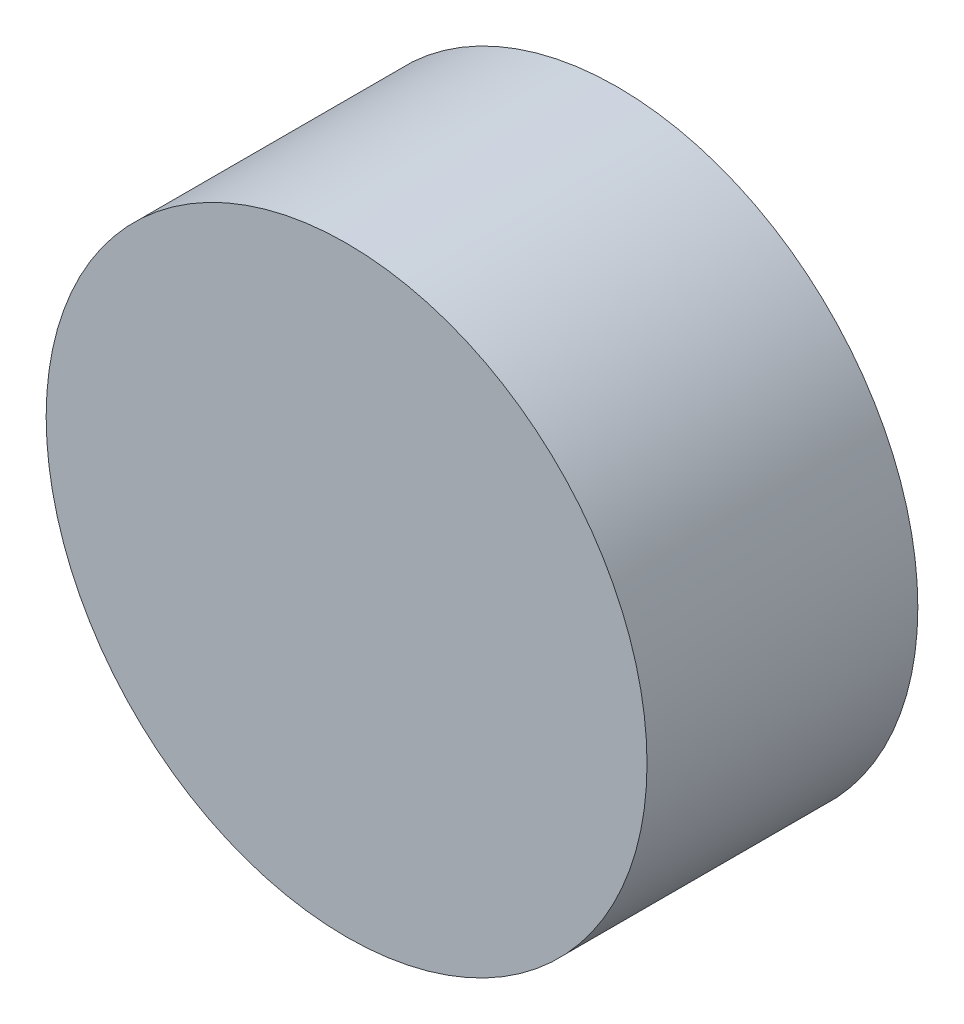
ISO-10303-21;
HEADER;
FILE_DESCRIPTION(('STEP AP214'),'2;1');
FILE_NAME('part.step','',(''),(''),'','','');
FILE_SCHEMA(('AUTOMOTIVE_DESIGN { 1 0 10303 214 1 1 1 1 }'));
ENDSEC;
DATA;
#1=APPLICATION_CONTEXT('core data for automotive mechanical design processes');
#2=APPLICATION_PROTOCOL_DEFINITION('international standard','automotive_design',2000,#1);
#3=PRODUCT_CONTEXT('',#1,'mechanical');
#4=PRODUCT('Part','Part','',(#3));
#5=PRODUCT_RELATED_PRODUCT_CATEGORY('part','',(#4));
#6=PRODUCT_DEFINITION_FORMATION('','',#4);
#7=PRODUCT_DEFINITION_CONTEXT('part definition',#1,'design');
#8=PRODUCT_DEFINITION('design','',#6,#7);
#9=PRODUCT_DEFINITION_SHAPE('','',#8);
#10=(LENGTH_UNIT() NAMED_UNIT(*) SI_UNIT(.MILLI.,.METRE.));
#11=(NAMED_UNIT(*) PLANE_ANGLE_UNIT() SI_UNIT($,.RADIAN.));
#12=(NAMED_UNIT(*) SI_UNIT($,.STERADIAN.) SOLID_ANGLE_UNIT());
#13=UNCERTAINTY_MEASURE_WITH_UNIT(LENGTH_MEASURE(1.E-05),#10,'distance_accuracy_value','');
#14=(GEOMETRIC_REPRESENTATION_CONTEXT(3) GLOBAL_UNCERTAINTY_ASSIGNED_CONTEXT((#13)) GLOBAL_UNIT_ASSIGNED_CONTEXT((#10,
#11,#12)) REPRESENTATION_CONTEXT('',''));
#15=CARTESIAN_POINT('',(0.,0.,0.));
#16=DIRECTION('',(0.,0.,1.));
#17=DIRECTION('',(1.,0.,0.));
#18=AXIS2_PLACEMENT_3D('',#15,#16,#17);
#19=CARTESIAN_POINT('',(0.,0.,32.));
#20=DIRECTION('',(0.,0.,-1.));
#21=DIRECTION('',(-1.,0.,0.));
#22=AXIS2_PLACEMENT_3D('',#19,#20,#21);
#23=CYLINDRICAL_SURFACE('',#22,35.5);
#24=CARTESIAN_POINT('',(0.,0.,32.));
#25=DIRECTION('',(0.,0.,1.));
#26=DIRECTION('',(1.,0.,0.));
#27=AXIS2_PLACEMENT_3D('',#24,#25,#26);
#28=CIRCLE('',#27,35.5);
#29=CARTESIAN_POINT('',(35.5,0.,32.));
#30=VERTEX_POINT('',#29);
#31=EDGE_CURVE('E10',#30,#30,#28,.T.);
#32=ORIENTED_EDGE('',*,*,#31,.F.);
#33=EDGE_LOOP('',(#32));
#34=FACE_BOUND('',#33,.T.);
#35=CARTESIAN_POINT('',(0.,0.,0.));
#36=DIRECTION('',(0.,0.,1.));
#37=DIRECTION('',(1.,0.,0.));
#38=AXIS2_PLACEMENT_3D('',#35,#36,#37);
#39=CIRCLE('',#38,35.5);
#40=CARTESIAN_POINT('',(35.5,0.,0.));
#41=VERTEX_POINT('',#40);
#42=EDGE_CURVE('E40',#41,#41,#39,.T.);
#43=ORIENTED_EDGE('',*,*,#42,.T.);
#44=EDGE_LOOP('',(#43));
#45=FACE_BOUND('',#44,.T.);
#46=ADVANCED_FACE('F37',(#34,#45),#23,.T.);
#47=CARTESIAN_POINT('',(0.,0.,32.));
#48=DIRECTION('',(0.,0.,1.));
#49=DIRECTION('',(1.,0.,0.));
#50=AXIS2_PLACEMENT_3D('',#47,#48,#49);
#51=PLANE('',#50);
#52=ORIENTED_EDGE('',*,*,#31,.T.);
#53=EDGE_LOOP('',(#52));
#54=FACE_BOUND('',#53,.T.);
#55=ADVANCED_FACE('F54',(#54),#51,.T.);
#56=CARTESIAN_POINT('',(0.,0.,0.));
#57=DIRECTION('',(0.,0.,1.));
#58=DIRECTION('',(1.,0.,0.));
#59=AXIS2_PLACEMENT_3D('',#56,#57,#58);
#60=PLANE('',#59);
#61=ORIENTED_EDGE('',*,*,#42,.F.);
#62=EDGE_LOOP('',(#61));
#63=FACE_BOUND('',#62,.T.);
#64=ADVANCED_FACE('F52',(#63),#60,.F.);
#65=CLOSED_SHELL('',(#46,#55,#64));
#66=MANIFOLD_SOLID_BREP('B2',#65);
#67=ADVANCED_BREP_SHAPE_REPRESENTATION('',(#18,#66),#14);
#68=SHAPE_DEFINITION_REPRESENTATION(#9,#67);
ENDSEC;
END-ISO-10303-21;
